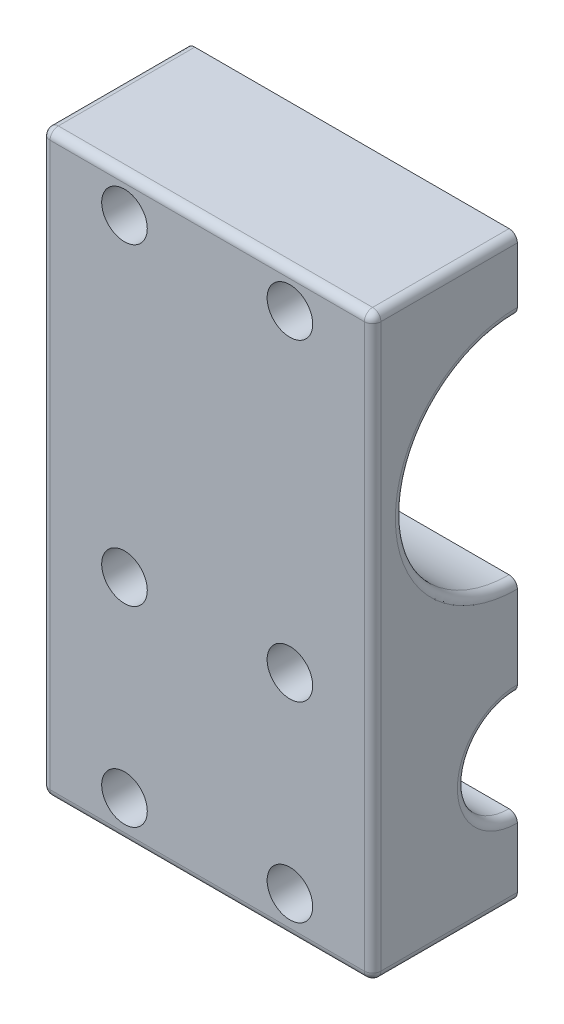
ISO-10303-21;
HEADER;
FILE_DESCRIPTION(('STEP AP214'),'2;1');
FILE_NAME('part.step','',(''),(''),'','','');
FILE_SCHEMA(('AUTOMOTIVE_DESIGN { 1 0 10303 214 1 1 1 1 }'));
ENDSEC;
DATA;
#1=APPLICATION_CONTEXT('core data for automotive mechanical design processes');
#2=APPLICATION_PROTOCOL_DEFINITION('international standard','automotive_design',2000,#1);
#3=PRODUCT_CONTEXT('',#1,'mechanical');
#4=PRODUCT('Part','Part','',(#3));
#5=PRODUCT_RELATED_PRODUCT_CATEGORY('part','',(#4));
#6=PRODUCT_DEFINITION_FORMATION('','',#4);
#7=PRODUCT_DEFINITION_CONTEXT('part definition',#1,'design');
#8=PRODUCT_DEFINITION('design','',#6,#7);
#9=PRODUCT_DEFINITION_SHAPE('','',#8);
#10=(LENGTH_UNIT() NAMED_UNIT(*) SI_UNIT(.MILLI.,.METRE.));
#11=(NAMED_UNIT(*) PLANE_ANGLE_UNIT() SI_UNIT($,.RADIAN.));
#12=(NAMED_UNIT(*) SI_UNIT($,.STERADIAN.) SOLID_ANGLE_UNIT());
#13=UNCERTAINTY_MEASURE_WITH_UNIT(LENGTH_MEASURE(1.E-05),#10,'distance_accuracy_value','');
#14=(GEOMETRIC_REPRESENTATION_CONTEXT(3) GLOBAL_UNCERTAINTY_ASSIGNED_CONTEXT((#13)) GLOBAL_UNIT_ASSIGNED_CONTEXT((#10,
#11,#12)) REPRESENTATION_CONTEXT('',''));
#15=CARTESIAN_POINT('',(0.,0.,0.));
#16=DIRECTION('',(0.,0.,1.));
#17=DIRECTION('',(1.,0.,0.));
#18=AXIS2_PLACEMENT_3D('',#15,#16,#17);
#19=CARTESIAN_POINT('',(0.,0.,-22.225));
#20=DIRECTION('',(0.,0.,1.));
#21=DIRECTION('',(1.,0.,0.));
#22=AXIS2_PLACEMENT_3D('',#19,#20,#21);
#23=PLANE('',#22);
#24=DIRECTION('',(1.,0.,0.));
#25=VECTOR('',#24,1.);
#26=CARTESIAN_POINT('',(50.8,88.9,-22.225));
#27=LINE('',#26,#25);
#28=CARTESIAN_POINT('',(1.27,88.9,-22.225));
#29=VERTEX_POINT('',#28);
#30=CARTESIAN_POINT('',(49.53,88.9,-22.225));
#31=VERTEX_POINT('',#30);
#32=EDGE_CURVE('E493',#29,#31,#27,.T.);
#33=ORIENTED_EDGE('',*,*,#32,.T.);
#34=CARTESIAN_POINT('',(49.53,87.63,-22.225));
#35=DIRECTION('',(0.,0.,1.));
#36=DIRECTION('',(1.,0.,0.));
#37=AXIS2_PLACEMENT_3D('',#34,#35,#36);
#38=CIRCLE('',#37,1.27);
#39=CARTESIAN_POINT('',(50.8,87.63,-22.225));
#40=VERTEX_POINT('',#39);
#41=EDGE_CURVE('E93',#31,#40,#38,.F.);
#42=ORIENTED_EDGE('',*,*,#41,.T.);
#43=DIRECTION('',(0.,-1.,0.));
#44=VECTOR('',#43,1.);
#45=CARTESIAN_POINT('',(50.8,0.,-22.225));
#46=LINE('',#45,#44);
#47=CARTESIAN_POINT('',(50.8,79.0575,-22.225));
#48=VERTEX_POINT('',#47);
#49=EDGE_CURVE('E86',#40,#48,#46,.T.);
#50=ORIENTED_EDGE('',*,*,#49,.T.);
#51=CARTESIAN_POINT('',(49.53,79.0575,-22.225));
#52=DIRECTION('',(0.,0.,1.));
#53=DIRECTION('',(1.,0.,0.));
#54=AXIS2_PLACEMENT_3D('',#51,#52,#53);
#55=CIRCLE('',#54,1.27);
#56=CARTESIAN_POINT('',(49.53,77.7875,-22.225));
#57=VERTEX_POINT('',#56);
#58=EDGE_CURVE('E216',#48,#57,#55,.F.);
#59=ORIENTED_EDGE('',*,*,#58,.T.);
#60=DIRECTION('',(-1.,0.,0.));
#61=VECTOR('',#60,1.);
#62=CARTESIAN_POINT('',(50.8,77.7875,-22.225));
#63=LINE('',#62,#61);
#64=CARTESIAN_POINT('',(1.27,77.7875,-22.225));
#65=VERTEX_POINT('',#64);
#66=EDGE_CURVE('E217',#57,#65,#63,.T.);
#67=ORIENTED_EDGE('',*,*,#66,.T.);
#68=CARTESIAN_POINT('',(1.27,79.0575,-22.225));
#69=DIRECTION('',(0.,0.,1.));
#70=DIRECTION('',(1.,0.,0.));
#71=AXIS2_PLACEMENT_3D('',#68,#69,#70);
#72=CIRCLE('',#71,1.27);
#73=CARTESIAN_POINT('',(0.,79.0575,-22.225));
#74=VERTEX_POINT('',#73);
#75=EDGE_CURVE('E79',#65,#74,#72,.F.);
#76=ORIENTED_EDGE('',*,*,#75,.T.);
#77=DIRECTION('',(0.,-1.,0.));
#78=VECTOR('',#77,1.);
#79=CARTESIAN_POINT('',(0.,0.,-22.225));
#80=LINE('',#79,#78);
#81=CARTESIAN_POINT('',(0.,87.63,-22.225));
#82=VERTEX_POINT('',#81);
#83=EDGE_CURVE('E209',#82,#74,#80,.T.);
#84=ORIENTED_EDGE('',*,*,#83,.F.);
#85=CARTESIAN_POINT('',(1.27,87.63,-22.225));
#86=DIRECTION('',(0.,0.,1.));
#87=DIRECTION('',(1.,0.,0.));
#88=AXIS2_PLACEMENT_3D('',#85,#86,#87);
#89=CIRCLE('',#88,1.27);
#90=EDGE_CURVE('E496',#82,#29,#89,.F.);
#91=ORIENTED_EDGE('',*,*,#90,.T.);
#92=EDGE_LOOP('',(#33,#42,#50,#59,#67,#76,#84,#91));
#93=FACE_BOUND('',#92,.T.);
#94=CARTESIAN_POINT('',(38.1,83.34375,-22.225));
#95=DIRECTION('',(0.,0.,1.));
#96=DIRECTION('',(1.,0.,0.));
#97=AXIS2_PLACEMENT_3D('',#94,#95,#96);
#98=CIRCLE('',#97,2.032);
#99=CARTESIAN_POINT('',(40.132,83.34375,-22.225));
#100=VERTEX_POINT('',#99);
#101=EDGE_CURVE('E432',#100,#100,#98,.F.);
#102=ORIENTED_EDGE('',*,*,#101,.F.);
#103=EDGE_LOOP('',(#102));
#104=FACE_BOUND('',#103,.T.);
#105=CARTESIAN_POINT('',(12.7,83.34375,-22.225));
#106=DIRECTION('',(0.,0.,1.));
#107=DIRECTION('',(1.,0.,0.));
#108=AXIS2_PLACEMENT_3D('',#105,#106,#107);
#109=CIRCLE('',#108,2.032);
#110=CARTESIAN_POINT('',(14.732,83.34375,-22.225));
#111=VERTEX_POINT('',#110);
#112=EDGE_CURVE('E277',#111,#111,#109,.F.);
#113=ORIENTED_EDGE('',*,*,#112,.F.);
#114=EDGE_LOOP('',(#113));
#115=FACE_BOUND('',#114,.T.);
#116=ADVANCED_FACE('F70',(#93,#104,#115),#23,.F.);
#117=CARTESIAN_POINT('',(12.7,83.34375,-44.45));
#118=DIRECTION('',(0.,0.,1.));
#119=DIRECTION('',(1.,0.,0.));
#120=AXIS2_PLACEMENT_3D('',#117,#118,#119);
#121=CYLINDRICAL_SURFACE('',#120,2.032);
#122=ORIENTED_EDGE('',*,*,#112,.T.);
#123=EDGE_LOOP('',(#122));
#124=FACE_BOUND('',#123,.T.);
#125=CARTESIAN_POINT('',(12.7,83.34375,-15.1765));
#126=DIRECTION('',(0.,0.,1.));
#127=DIRECTION('',(1.,0.,0.));
#128=AXIS2_PLACEMENT_3D('',#125,#126,#127);
#129=CIRCLE('',#128,2.032);
#130=CARTESIAN_POINT('',(14.732,83.34375,-15.1765));
#131=VERTEX_POINT('',#130);
#132=EDGE_CURVE('E350',#131,#131,#129,.F.);
#133=ORIENTED_EDGE('',*,*,#132,.F.);
#134=EDGE_LOOP('',(#133));
#135=FACE_BOUND('',#134,.T.);
#136=ADVANCED_FACE('F617',(#124,#135),#121,.F.);
#137=CARTESIAN_POINT('',(38.1,5.87374999999999,-44.45));
#138=DIRECTION('',(0.,0.,1.));
#139=DIRECTION('',(1.,0.,0.));
#140=AXIS2_PLACEMENT_3D('',#137,#138,#139);
#141=CYLINDRICAL_SURFACE('',#140,2.032);
#142=CARTESIAN_POINT('',(38.1,5.87374999999999,-22.225));
#143=DIRECTION('',(0.,0.,1.));
#144=DIRECTION('',(1.,0.,0.));
#145=AXIS2_PLACEMENT_3D('',#142,#143,#144);
#146=CIRCLE('',#145,2.032);
#147=CARTESIAN_POINT('',(40.132,5.87374999999999,-22.225));
#148=VERTEX_POINT('',#147);
#149=EDGE_CURVE('E424',#148,#148,#146,.F.);
#150=ORIENTED_EDGE('',*,*,#149,.T.);
#151=EDGE_LOOP('',(#150));
#152=FACE_BOUND('',#151,.T.);
#153=CARTESIAN_POINT('',(38.1,5.87374999999999,-15.1765));
#154=DIRECTION('',(0.,0.,1.));
#155=DIRECTION('',(1.,0.,0.));
#156=AXIS2_PLACEMENT_3D('',#153,#154,#155);
#157=CIRCLE('',#156,2.032);
#158=CARTESIAN_POINT('',(40.132,5.87374999999999,-15.1765));
#159=VERTEX_POINT('',#158);
#160=EDGE_CURVE('E354',#159,#159,#157,.F.);
#161=ORIENTED_EDGE('',*,*,#160,.F.);
#162=EDGE_LOOP('',(#161));
#163=FACE_BOUND('',#162,.T.);
#164=ADVANCED_FACE('F622',(#152,#163),#141,.F.);
#165=CARTESIAN_POINT('',(12.7,35.2425,-44.45));
#166=DIRECTION('',(0.,0.,1.));
#167=DIRECTION('',(1.,0.,0.));
#168=AXIS2_PLACEMENT_3D('',#165,#166,#167);
#169=CYLINDRICAL_SURFACE('',#168,2.032);
#170=CARTESIAN_POINT('',(12.7,35.2425,-22.225));
#171=DIRECTION('',(0.,0.,1.));
#172=DIRECTION('',(1.,0.,0.));
#173=AXIS2_PLACEMENT_3D('',#170,#171,#172);
#174=CIRCLE('',#173,2.032);
#175=CARTESIAN_POINT('',(14.732,35.2425,-22.225));
#176=VERTEX_POINT('',#175);
#177=EDGE_CURVE('E428',#176,#176,#174,.F.);
#178=ORIENTED_EDGE('',*,*,#177,.T.);
#179=EDGE_LOOP('',(#178));
#180=FACE_BOUND('',#179,.T.);
#181=CARTESIAN_POINT('',(12.7,35.2425,-15.1765));
#182=DIRECTION('',(0.,0.,1.));
#183=DIRECTION('',(1.,0.,0.));
#184=AXIS2_PLACEMENT_3D('',#181,#182,#183);
#185=CIRCLE('',#184,2.032);
#186=CARTESIAN_POINT('',(14.732,35.2425,-15.1765));
#187=VERTEX_POINT('',#186);
#188=EDGE_CURVE('E358',#187,#187,#185,.F.);
#189=ORIENTED_EDGE('',*,*,#188,.F.);
#190=EDGE_LOOP('',(#189));
#191=FACE_BOUND('',#190,.T.);
#192=ADVANCED_FACE('F683',(#180,#191),#169,.F.);
#193=CARTESIAN_POINT('',(38.1,83.34375,-44.45));
#194=DIRECTION('',(0.,0.,1.));
#195=DIRECTION('',(1.,0.,0.));
#196=AXIS2_PLACEMENT_3D('',#193,#194,#195);
#197=CYLINDRICAL_SURFACE('',#196,2.032);
#198=ORIENTED_EDGE('',*,*,#101,.T.);
#199=EDGE_LOOP('',(#198));
#200=FACE_BOUND('',#199,.T.);
#201=CARTESIAN_POINT('',(38.1,83.34375,-15.1765));
#202=DIRECTION('',(0.,0.,1.));
#203=DIRECTION('',(1.,0.,0.));
#204=AXIS2_PLACEMENT_3D('',#201,#202,#203);
#205=CIRCLE('',#204,2.032);
#206=CARTESIAN_POINT('',(40.132,83.34375,-15.1765));
#207=VERTEX_POINT('',#206);
#208=EDGE_CURVE('E362',#207,#207,#205,.F.);
#209=ORIENTED_EDGE('',*,*,#208,.F.);
#210=EDGE_LOOP('',(#209));
#211=FACE_BOUND('',#210,.T.);
#212=ADVANCED_FACE('F679',(#200,#211),#197,.F.);
#213=CARTESIAN_POINT('',(38.1,35.2425,-44.45));
#214=DIRECTION('',(0.,0.,1.));
#215=DIRECTION('',(1.,0.,0.));
#216=AXIS2_PLACEMENT_3D('',#213,#214,#215);
#217=CYLINDRICAL_SURFACE('',#216,2.032);
#218=CARTESIAN_POINT('',(38.1,35.2425,-22.225));
#219=DIRECTION('',(0.,0.,1.));
#220=DIRECTION('',(1.,0.,0.));
#221=AXIS2_PLACEMENT_3D('',#218,#219,#220);
#222=CIRCLE('',#221,2.032);
#223=CARTESIAN_POINT('',(40.132,35.2425,-22.225));
#224=VERTEX_POINT('',#223);
#225=EDGE_CURVE('E436',#224,#224,#222,.F.);
#226=ORIENTED_EDGE('',*,*,#225,.T.);
#227=EDGE_LOOP('',(#226));
#228=FACE_BOUND('',#227,.T.);
#229=CARTESIAN_POINT('',(38.1,35.2425,-15.1765));
#230=DIRECTION('',(0.,0.,1.));
#231=DIRECTION('',(1.,0.,0.));
#232=AXIS2_PLACEMENT_3D('',#229,#230,#231);
#233=CIRCLE('',#232,2.032);
#234=CARTESIAN_POINT('',(40.132,35.2425,-15.1765));
#235=VERTEX_POINT('',#234);
#236=EDGE_CURVE('E366',#235,#235,#233,.F.);
#237=ORIENTED_EDGE('',*,*,#236,.F.);
#238=EDGE_LOOP('',(#237));
#239=FACE_BOUND('',#238,.T.);
#240=ADVANCED_FACE('F682',(#228,#239),#217,.F.);
#241=CARTESIAN_POINT('',(12.7,5.87374999999999,-44.45));
#242=DIRECTION('',(0.,0.,1.));
#243=DIRECTION('',(1.,0.,0.));
#244=AXIS2_PLACEMENT_3D('',#241,#242,#243);
#245=CYLINDRICAL_SURFACE('',#244,2.032);
#246=CARTESIAN_POINT('',(12.7,5.87374999999999,-22.225));
#247=DIRECTION('',(0.,0.,1.));
#248=DIRECTION('',(1.,0.,0.));
#249=AXIS2_PLACEMENT_3D('',#246,#247,#248);
#250=CIRCLE('',#249,2.032);
#251=CARTESIAN_POINT('',(14.732,5.87374999999999,-22.225));
#252=VERTEX_POINT('',#251);
#253=EDGE_CURVE('E440',#252,#252,#250,.F.);
#254=ORIENTED_EDGE('',*,*,#253,.T.);
#255=EDGE_LOOP('',(#254));
#256=FACE_BOUND('',#255,.T.);
#257=CARTESIAN_POINT('',(12.7,5.87374999999999,-15.1765));
#258=DIRECTION('',(0.,0.,1.));
#259=DIRECTION('',(1.,0.,0.));
#260=AXIS2_PLACEMENT_3D('',#257,#258,#259);
#261=CIRCLE('',#260,2.032);
#262=CARTESIAN_POINT('',(14.732,5.87374999999999,-15.1765));
#263=VERTEX_POINT('',#262);
#264=EDGE_CURVE('E370',#263,#263,#261,.F.);
#265=ORIENTED_EDGE('',*,*,#264,.F.);
#266=EDGE_LOOP('',(#265));
#267=FACE_BOUND('',#266,.T.);
#268=ADVANCED_FACE('F673',(#256,#267),#245,.F.);
#269=CARTESIAN_POINT('',(50.8,0.,0.));
#270=DIRECTION('',(1.,0.,0.));
#271=DIRECTION('',(0.,0.,-1.));
#272=AXIS2_PLACEMENT_3D('',#269,#270,#271);
#273=PLANE('',#272);
#274=ORIENTED_EDGE('',*,*,#49,.F.);
#275=DIRECTION('',(0.,0.,-1.));
#276=VECTOR('',#275,1.);
#277=CARTESIAN_POINT('',(50.8,87.63,0.));
#278=LINE('',#277,#276);
#279=CARTESIAN_POINT('',(50.8,87.63,-1.26999999999999));
#280=VERTEX_POINT('',#279);
#281=EDGE_CURVE('E305',#40,#280,#278,.F.);
#282=ORIENTED_EDGE('',*,*,#281,.T.);
#283=DIRECTION('',(0.,1.,0.));
#284=VECTOR('',#283,1.);
#285=CARTESIAN_POINT('',(50.8,0.,-1.27));
#286=LINE('',#285,#284);
#287=CARTESIAN_POINT('',(50.8,1.27,-1.27));
#288=VERTEX_POINT('',#287);
#289=EDGE_CURVE('E302',#280,#288,#286,.F.);
#290=ORIENTED_EDGE('',*,*,#289,.T.);
#291=DIRECTION('',(0.,0.,-1.));
#292=VECTOR('',#291,1.);
#293=CARTESIAN_POINT('',(50.8,1.27,-44.45));
#294=LINE('',#293,#292);
#295=CARTESIAN_POINT('',(50.8,1.27,-22.225));
#296=VERTEX_POINT('',#295);
#297=EDGE_CURVE('E298',#288,#296,#294,.T.);
#298=ORIENTED_EDGE('',*,*,#297,.T.);
#299=CARTESIAN_POINT('',(50.8,10.4775,-22.225));
#300=VERTEX_POINT('',#299);
#301=EDGE_CURVE('E459',#300,#296,#46,.T.);
#302=ORIENTED_EDGE('',*,*,#301,.F.);
#303=CARTESIAN_POINT('',(50.8,19.685,-22.225));
#304=DIRECTION('',(1.,0.,0.));
#305=DIRECTION('',(0.,0.,-1.));
#306=AXIS2_PLACEMENT_3D('',#303,#304,#305);
#307=CIRCLE('',#306,9.2075);
#308=CARTESIAN_POINT('',(50.8,28.8925,-22.225));
#309=VERTEX_POINT('',#308);
#310=EDGE_CURVE('E291',#300,#309,#307,.F.);
#311=ORIENTED_EDGE('',*,*,#310,.T.);
#312=CARTESIAN_POINT('',(50.8,41.5925,-22.225));
#313=VERTEX_POINT('',#312);
#314=EDGE_CURVE('E472',#313,#309,#46,.T.);
#315=ORIENTED_EDGE('',*,*,#314,.F.);
#316=CARTESIAN_POINT('',(50.8,60.325,-22.225));
#317=DIRECTION('',(1.,0.,0.));
#318=DIRECTION('',(0.,0.,-1.));
#319=AXIS2_PLACEMENT_3D('',#316,#317,#318);
#320=CIRCLE('',#319,18.7325);
#321=EDGE_CURVE('E295',#313,#48,#320,.F.);
#322=ORIENTED_EDGE('',*,*,#321,.T.);
#323=EDGE_LOOP('',(#274,#282,#290,#298,#302,#311,#315,#322));
#324=FACE_BOUND('',#323,.T.);
#325=ADVANCED_FACE('F562',(#324),#273,.T.);
#326=CARTESIAN_POINT('',(0.,0.,0.));
#327=DIRECTION('',(1.,0.,0.));
#328=DIRECTION('',(0.,0.,-1.));
#329=AXIS2_PLACEMENT_3D('',#326,#327,#328);
#330=PLANE('',#329);
#331=DIRECTION('',(0.,0.,-1.));
#332=VECTOR('',#331,1.);
#333=CARTESIAN_POINT('',(0.,87.63,-44.45));
#334=LINE('',#333,#332);
#335=CARTESIAN_POINT('',(0.,87.63,-1.26999999999999));
#336=VERTEX_POINT('',#335);
#337=EDGE_CURVE('E212',#336,#82,#334,.T.);
#338=ORIENTED_EDGE('',*,*,#337,.T.);
#339=ORIENTED_EDGE('',*,*,#83,.T.);
#340=CARTESIAN_POINT('',(0.,60.325,-22.225));
#341=DIRECTION('',(1.,0.,0.));
#342=DIRECTION('',(0.,0.,-1.));
#343=AXIS2_PLACEMENT_3D('',#340,#341,#342);
#344=CIRCLE('',#343,18.7325);
#345=CARTESIAN_POINT('',(0.,41.5925,-22.225));
#346=VERTEX_POINT('',#345);
#347=EDGE_CURVE('E197',#74,#346,#344,.T.);
#348=ORIENTED_EDGE('',*,*,#347,.T.);
#349=CARTESIAN_POINT('',(0.,28.8925,-22.225));
#350=VERTEX_POINT('',#349);
#351=EDGE_CURVE('E220',#346,#350,#80,.T.);
#352=ORIENTED_EDGE('',*,*,#351,.T.);
#353=CARTESIAN_POINT('',(0.,19.685,-22.225));
#354=DIRECTION('',(1.,0.,0.));
#355=DIRECTION('',(0.,0.,-1.));
#356=AXIS2_PLACEMENT_3D('',#353,#354,#355);
#357=CIRCLE('',#356,9.2075);
#358=CARTESIAN_POINT('',(0.,10.4775,-22.225));
#359=VERTEX_POINT('',#358);
#360=EDGE_CURVE('E204',#350,#359,#357,.T.);
#361=ORIENTED_EDGE('',*,*,#360,.T.);
#362=CARTESIAN_POINT('',(0.,1.27,-22.225));
#363=VERTEX_POINT('',#362);
#364=EDGE_CURVE('E219',#359,#363,#80,.T.);
#365=ORIENTED_EDGE('',*,*,#364,.T.);
#366=DIRECTION('',(0.,0.,-1.));
#367=VECTOR('',#366,1.);
#368=CARTESIAN_POINT('',(0.,1.27,0.));
#369=LINE('',#368,#367);
#370=CARTESIAN_POINT('',(0.,1.27,-1.27));
#371=VERTEX_POINT('',#370);
#372=EDGE_CURVE('E205',#363,#371,#369,.F.);
#373=ORIENTED_EDGE('',*,*,#372,.T.);
#374=DIRECTION('',(0.,1.,0.));
#375=VECTOR('',#374,1.);
#376=CARTESIAN_POINT('',(0.,88.9,-1.26999999999999));
#377=LINE('',#376,#375);
#378=EDGE_CURVE('E321',#371,#336,#377,.T.);
#379=ORIENTED_EDGE('',*,*,#378,.T.);
#380=EDGE_LOOP('',(#338,#339,#348,#352,#361,#365,#373,#379));
#381=FACE_BOUND('',#380,.T.);
#382=ADVANCED_FACE('F210',(#381),#330,.F.);
#383=CARTESIAN_POINT('',(50.8,0.,0.));
#384=DIRECTION('',(0.,1.,0.));
#385=DIRECTION('',(0.,0.,1.));
#386=AXIS2_PLACEMENT_3D('',#383,#384,#385);
#387=PLANE('',#386);
#388=DIRECTION('',(0.,0.,-1.));
#389=VECTOR('',#388,1.);
#390=CARTESIAN_POINT('',(1.27,0.,0.));
#391=LINE('',#390,#389);
#392=CARTESIAN_POINT('',(1.27,0.,-1.27));
#393=VERTEX_POINT('',#392);
#394=CARTESIAN_POINT('',(1.27,0.,-22.225));
#395=VERTEX_POINT('',#394);
#396=EDGE_CURVE('E339',#393,#395,#391,.T.);
#397=ORIENTED_EDGE('',*,*,#396,.T.);
#398=DIRECTION('',(1.,0.,0.));
#399=VECTOR('',#398,1.);
#400=CARTESIAN_POINT('',(50.8,0.,-22.225));
#401=LINE('',#400,#399);
#402=CARTESIAN_POINT('',(49.53,0.,-22.225));
#403=VERTEX_POINT('',#402);
#404=EDGE_CURVE('E448',#395,#403,#401,.T.);
#405=ORIENTED_EDGE('',*,*,#404,.T.);
#406=DIRECTION('',(0.,0.,-1.));
#407=VECTOR('',#406,1.);
#408=CARTESIAN_POINT('',(49.53,0.,0.));
#409=LINE('',#408,#407);
#410=CARTESIAN_POINT('',(49.53,0.,-1.27));
#411=VERTEX_POINT('',#410);
#412=EDGE_CURVE('E347',#403,#411,#409,.F.);
#413=ORIENTED_EDGE('',*,*,#412,.T.);
#414=DIRECTION('',(-1.,0.,0.));
#415=VECTOR('',#414,1.);
#416=CARTESIAN_POINT('',(0.,0.,-1.27));
#417=LINE('',#416,#415);
#418=EDGE_CURVE('E343',#411,#393,#417,.T.);
#419=ORIENTED_EDGE('',*,*,#418,.T.);
#420=EDGE_LOOP('',(#397,#405,#413,#419));
#421=FACE_BOUND('',#420,.T.);
#422=ADVANCED_FACE('F522',(#421),#387,.F.);
#423=CARTESIAN_POINT('',(50.8,88.9,0.));
#424=DIRECTION('',(0.,1.,0.));
#425=DIRECTION('',(0.,0.,1.));
#426=AXIS2_PLACEMENT_3D('',#423,#424,#425);
#427=PLANE('',#426);
#428=ORIENTED_EDGE('',*,*,#32,.F.);
#429=DIRECTION('',(0.,0.,-1.));
#430=VECTOR('',#429,1.);
#431=CARTESIAN_POINT('',(1.27,88.9,0.));
#432=LINE('',#431,#430);
#433=CARTESIAN_POINT('',(1.27,88.9,-1.26999999999999));
#434=VERTEX_POINT('',#433);
#435=EDGE_CURVE('E229',#29,#434,#432,.F.);
#436=ORIENTED_EDGE('',*,*,#435,.T.);
#437=DIRECTION('',(-1.,0.,0.));
#438=VECTOR('',#437,1.);
#439=CARTESIAN_POINT('',(50.8,88.9,-1.26999999999999));
#440=LINE('',#439,#438);
#441=CARTESIAN_POINT('',(49.53,88.9,-1.26999999999999));
#442=VERTEX_POINT('',#441);
#443=EDGE_CURVE('E226',#434,#442,#440,.F.);
#444=ORIENTED_EDGE('',*,*,#443,.T.);
#445=DIRECTION('',(0.,0.,-1.));
#446=VECTOR('',#445,1.);
#447=CARTESIAN_POINT('',(49.53,88.9,0.));
#448=LINE('',#447,#446);
#449=EDGE_CURVE('E281',#442,#31,#448,.T.);
#450=ORIENTED_EDGE('',*,*,#449,.T.);
#451=EDGE_LOOP('',(#428,#436,#444,#450));
#452=FACE_BOUND('',#451,.T.);
#453=ADVANCED_FACE('F557',(#452),#427,.T.);
#454=CARTESIAN_POINT('',(50.8,0.,0.));
#455=DIRECTION('',(0.,0.,1.));
#456=DIRECTION('',(0.,-1.,0.));
#457=AXIS2_PLACEMENT_3D('',#454,#455,#456);
#458=PLANE('',#457);
#459=DIRECTION('',(0.,1.,0.));
#460=VECTOR('',#459,1.);
#461=CARTESIAN_POINT('',(1.27,0.,0.));
#462=LINE('',#461,#460);
#463=CARTESIAN_POINT('',(1.27,87.63,0.));
#464=VERTEX_POINT('',#463);
#465=CARTESIAN_POINT('',(1.27,1.27,0.));
#466=VERTEX_POINT('',#465);
#467=EDGE_CURVE('E333',#464,#466,#462,.F.);
#468=ORIENTED_EDGE('',*,*,#467,.T.);
#469=DIRECTION('',(-1.,0.,0.));
#470=VECTOR('',#469,1.);
#471=CARTESIAN_POINT('',(50.8,1.27,0.));
#472=LINE('',#471,#470);
#473=CARTESIAN_POINT('',(49.53,1.27,0.));
#474=VERTEX_POINT('',#473);
#475=EDGE_CURVE('E326',#466,#474,#472,.F.);
#476=ORIENTED_EDGE('',*,*,#475,.T.);
#477=DIRECTION('',(0.,1.,0.));
#478=VECTOR('',#477,1.);
#479=CARTESIAN_POINT('',(49.53,0.,0.));
#480=LINE('',#479,#478);
#481=CARTESIAN_POINT('',(49.53,87.63,0.));
#482=VERTEX_POINT('',#481);
#483=EDGE_CURVE('E330',#474,#482,#480,.T.);
#484=ORIENTED_EDGE('',*,*,#483,.T.);
#485=DIRECTION('',(-1.,0.,0.));
#486=VECTOR('',#485,1.);
#487=CARTESIAN_POINT('',(50.8,87.63,0.));
#488=LINE('',#487,#486);
#489=EDGE_CURVE('E336',#482,#464,#488,.T.);
#490=ORIENTED_EDGE('',*,*,#489,.T.);
#491=EDGE_LOOP('',(#468,#476,#484,#490));
#492=FACE_BOUND('',#491,.T.);
#493=CARTESIAN_POINT('',(38.1,83.34375,0.));
#494=DIRECTION('',(0.,0.,1.));
#495=DIRECTION('',(1.,0.,0.));
#496=AXIS2_PLACEMENT_3D('',#493,#494,#495);
#497=CIRCLE('',#496,3.5);
#498=CARTESIAN_POINT('',(41.6,83.34375,0.));
#499=VERTEX_POINT('',#498);
#500=EDGE_CURVE('E379',#499,#499,#497,.T.);
#501=ORIENTED_EDGE('',*,*,#500,.F.);
#502=EDGE_LOOP('',(#501));
#503=FACE_BOUND('',#502,.T.);
#504=CARTESIAN_POINT('',(38.1,35.2425,0.));
#505=DIRECTION('',(0.,0.,1.));
#506=DIRECTION('',(1.,0.,0.));
#507=AXIS2_PLACEMENT_3D('',#504,#505,#506);
#508=CIRCLE('',#507,3.5);
#509=CARTESIAN_POINT('',(41.6,35.2425,0.));
#510=VERTEX_POINT('',#509);
#511=EDGE_CURVE('E404',#510,#510,#508,.T.);
#512=ORIENTED_EDGE('',*,*,#511,.F.);
#513=EDGE_LOOP('',(#512));
#514=FACE_BOUND('',#513,.T.);
#515=CARTESIAN_POINT('',(12.7,35.2425,0.));
#516=DIRECTION('',(0.,0.,1.));
#517=DIRECTION('',(1.,0.,0.));
#518=AXIS2_PLACEMENT_3D('',#515,#516,#517);
#519=CIRCLE('',#518,3.5);
#520=CARTESIAN_POINT('',(16.2,35.2425,0.));
#521=VERTEX_POINT('',#520);
#522=EDGE_CURVE('E396',#521,#521,#519,.T.);
#523=ORIENTED_EDGE('',*,*,#522,.F.);
#524=EDGE_LOOP('',(#523));
#525=FACE_BOUND('',#524,.T.);
#526=CARTESIAN_POINT('',(12.7,5.87374999999999,0.));
#527=DIRECTION('',(0.,0.,1.));
#528=DIRECTION('',(1.,0.,0.));
#529=AXIS2_PLACEMENT_3D('',#526,#527,#528);
#530=CIRCLE('',#529,3.5);
#531=CARTESIAN_POINT('',(16.2,5.87374999999999,0.));
#532=VERTEX_POINT('',#531);
#533=EDGE_CURVE('E387',#532,#532,#530,.T.);
#534=ORIENTED_EDGE('',*,*,#533,.F.);
#535=EDGE_LOOP('',(#534));
#536=FACE_BOUND('',#535,.T.);
#537=CARTESIAN_POINT('',(38.1,5.87374999999999,0.));
#538=DIRECTION('',(0.,0.,1.));
#539=DIRECTION('',(1.,0.,0.));
#540=AXIS2_PLACEMENT_3D('',#537,#538,#539);
#541=CIRCLE('',#540,3.5);
#542=CARTESIAN_POINT('',(41.6,5.87374999999999,0.));
#543=VERTEX_POINT('',#542);
#544=EDGE_CURVE('E388',#543,#543,#541,.T.);
#545=ORIENTED_EDGE('',*,*,#544,.F.);
#546=EDGE_LOOP('',(#545));
#547=FACE_BOUND('',#546,.T.);
#548=CARTESIAN_POINT('',(12.7,83.34375,0.));
#549=DIRECTION('',(0.,0.,1.));
#550=DIRECTION('',(1.,0.,0.));
#551=AXIS2_PLACEMENT_3D('',#548,#549,#550);
#552=CIRCLE('',#551,3.5);
#553=CARTESIAN_POINT('',(16.2,83.34375,0.));
#554=VERTEX_POINT('',#553);
#555=EDGE_CURVE('E375',#554,#554,#552,.T.);
#556=ORIENTED_EDGE('',*,*,#555,.F.);
#557=EDGE_LOOP('',(#556));
#558=FACE_BOUND('',#557,.T.);
#559=ADVANCED_FACE('F584',(#492,#503,#514,#525,#536,#547,#558),#458,.T.);
#560=CARTESIAN_POINT('',(50.8,60.325,-22.225));
#561=DIRECTION('',(-1.,0.,0.));
#562=DIRECTION('',(0.,0.,1.));
#563=AXIS2_PLACEMENT_3D('',#560,#561,#562);
#564=CYLINDRICAL_SURFACE('',#563,17.4625);
#565=ORIENTED_EDGE('',*,*,#66,.F.);
#566=CARTESIAN_POINT('',(49.53,60.325,-22.225));
#567=DIRECTION('',(1.,0.,0.));
#568=DIRECTION('',(0.,0.,-1.));
#569=AXIS2_PLACEMENT_3D('',#566,#567,#568);
#570=CIRCLE('',#569,17.4625);
#571=CARTESIAN_POINT('',(49.53,42.8625,-22.225));
#572=VERTEX_POINT('',#571);
#573=EDGE_CURVE('E284',#57,#572,#570,.T.);
#574=ORIENTED_EDGE('',*,*,#573,.T.);
#575=DIRECTION('',(-1.,0.,0.));
#576=VECTOR('',#575,1.);
#577=CARTESIAN_POINT('',(50.8,42.8625,-22.225));
#578=LINE('',#577,#576);
#579=CARTESIAN_POINT('',(1.27,42.8625,-22.225));
#580=VERTEX_POINT('',#579);
#581=EDGE_CURVE('E485',#580,#572,#578,.F.);
#582=ORIENTED_EDGE('',*,*,#581,.F.);
#583=CARTESIAN_POINT('',(1.27,60.325,-22.225));
#584=DIRECTION('',(1.,0.,0.));
#585=DIRECTION('',(0.,0.,-1.));
#586=AXIS2_PLACEMENT_3D('',#583,#584,#585);
#587=CIRCLE('',#586,17.4625);
#588=EDGE_CURVE('E288',#580,#65,#587,.F.);
#589=ORIENTED_EDGE('',*,*,#588,.T.);
#590=EDGE_LOOP('',(#565,#574,#582,#589));
#591=FACE_BOUND('',#590,.T.);
#592=ADVANCED_FACE('F569',(#591),#564,.F.);
#593=CARTESIAN_POINT('',(50.8,19.685,-22.225));
#594=DIRECTION('',(-1.,0.,0.));
#595=DIRECTION('',(0.,0.,1.));
#596=AXIS2_PLACEMENT_3D('',#593,#594,#595);
#597=CYLINDRICAL_SURFACE('',#596,7.93750000000001);
#598=DIRECTION('',(-1.,0.,0.));
#599=VECTOR('',#598,1.);
#600=CARTESIAN_POINT('',(50.8,27.6225,-22.225));
#601=LINE('',#600,#599);
#602=CARTESIAN_POINT('',(49.53,27.6225,-22.225));
#603=VERTEX_POINT('',#602);
#604=CARTESIAN_POINT('',(1.27,27.6225,-22.225));
#605=VERTEX_POINT('',#604);
#606=EDGE_CURVE('E473',#603,#605,#601,.T.);
#607=ORIENTED_EDGE('',*,*,#606,.F.);
#608=CARTESIAN_POINT('',(49.53,19.685,-22.225));
#609=DIRECTION('',(1.,0.,0.));
#610=DIRECTION('',(0.,0.,-1.));
#611=AXIS2_PLACEMENT_3D('',#608,#609,#610);
#612=CIRCLE('',#611,7.93750000000001);
#613=CARTESIAN_POINT('',(49.53,11.7475,-22.225));
#614=VERTEX_POINT('',#613);
#615=EDGE_CURVE('E312',#603,#614,#612,.T.);
#616=ORIENTED_EDGE('',*,*,#615,.T.);
#617=DIRECTION('',(-1.,0.,0.));
#618=VECTOR('',#617,1.);
#619=CARTESIAN_POINT('',(50.8,11.7475,-22.225));
#620=LINE('',#619,#618);
#621=CARTESIAN_POINT('',(1.27,11.7475,-22.225));
#622=VERTEX_POINT('',#621);
#623=EDGE_CURVE('E460',#622,#614,#620,.F.);
#624=ORIENTED_EDGE('',*,*,#623,.F.);
#625=CARTESIAN_POINT('',(1.27,19.685,-22.225));
#626=DIRECTION('',(1.,0.,0.));
#627=DIRECTION('',(0.,0.,-1.));
#628=AXIS2_PLACEMENT_3D('',#625,#626,#627);
#629=CIRCLE('',#628,7.93750000000001);
#630=EDGE_CURVE('E308',#622,#605,#629,.F.);
#631=ORIENTED_EDGE('',*,*,#630,.T.);
#632=EDGE_LOOP('',(#607,#616,#624,#631));
#633=FACE_BOUND('',#632,.T.);
#634=ADVANCED_FACE('F574',(#633),#597,.F.);
#635=CARTESIAN_POINT('',(12.7,5.87374999999999,-15.1765));
#636=DIRECTION('',(0.,0.,1.));
#637=DIRECTION('',(1.,0.,0.));
#638=AXIS2_PLACEMENT_3D('',#635,#636,#637);
#639=PLANE('',#638);
#640=CARTESIAN_POINT('',(12.7,5.87374999999999,-15.1765));
#641=DIRECTION('',(0.,0.,1.));
#642=DIRECTION('',(1.,0.,0.));
#643=AXIS2_PLACEMENT_3D('',#640,#641,#642);
#644=CIRCLE('',#643,3.5);
#645=CARTESIAN_POINT('',(16.2,5.87374999999999,-15.1765));
#646=VERTEX_POINT('',#645);
#647=EDGE_CURVE('E383',#646,#646,#644,.T.);
#648=ORIENTED_EDGE('',*,*,#647,.T.);
#649=EDGE_LOOP('',(#648));
#650=FACE_BOUND('',#649,.T.);
#651=ORIENTED_EDGE('',*,*,#264,.T.);
#652=EDGE_LOOP('',(#651));
#653=FACE_BOUND('',#652,.T.);
#654=ADVANCED_FACE('F677',(#650,#653),#639,.T.);
#655=CARTESIAN_POINT('',(12.7,5.87374999999999,-15.1765));
#656=DIRECTION('',(0.,0.,1.));
#657=DIRECTION('',(1.,0.,0.));
#658=AXIS2_PLACEMENT_3D('',#655,#656,#657);
#659=CYLINDRICAL_SURFACE('',#658,3.5);
#660=ORIENTED_EDGE('',*,*,#647,.F.);
#661=EDGE_LOOP('',(#660));
#662=FACE_BOUND('',#661,.T.);
#663=ORIENTED_EDGE('',*,*,#533,.T.);
#664=EDGE_LOOP('',(#663));
#665=FACE_BOUND('',#664,.T.);
#666=ADVANCED_FACE('F729',(#662,#665),#659,.F.);
#667=CARTESIAN_POINT('',(38.1,35.2425,-15.1765));
#668=DIRECTION('',(0.,0.,1.));
#669=DIRECTION('',(1.,0.,0.));
#670=AXIS2_PLACEMENT_3D('',#667,#668,#669);
#671=PLANE('',#670);
#672=CARTESIAN_POINT('',(38.1,35.2425,-15.1765));
#673=DIRECTION('',(0.,0.,1.));
#674=DIRECTION('',(1.,0.,0.));
#675=AXIS2_PLACEMENT_3D('',#672,#673,#674);
#676=CIRCLE('',#675,3.5);
#677=CARTESIAN_POINT('',(41.6,35.2425,-15.1765));
#678=VERTEX_POINT('',#677);
#679=EDGE_CURVE('E400',#678,#678,#676,.T.);
#680=ORIENTED_EDGE('',*,*,#679,.T.);
#681=EDGE_LOOP('',(#680));
#682=FACE_BOUND('',#681,.T.);
#683=ORIENTED_EDGE('',*,*,#236,.T.);
#684=EDGE_LOOP('',(#683));
#685=FACE_BOUND('',#684,.T.);
#686=ADVANCED_FACE('F726',(#682,#685),#671,.T.);
#687=CARTESIAN_POINT('',(38.1,35.2425,-15.1765));
#688=DIRECTION('',(0.,0.,1.));
#689=DIRECTION('',(1.,0.,0.));
#690=AXIS2_PLACEMENT_3D('',#687,#688,#689);
#691=CYLINDRICAL_SURFACE('',#690,3.5);
#692=ORIENTED_EDGE('',*,*,#679,.F.);
#693=EDGE_LOOP('',(#692));
#694=FACE_BOUND('',#693,.T.);
#695=ORIENTED_EDGE('',*,*,#511,.T.);
#696=EDGE_LOOP('',(#695));
#697=FACE_BOUND('',#696,.T.);
#698=ADVANCED_FACE('F722',(#694,#697),#691,.F.);
#699=CARTESIAN_POINT('',(38.1,83.34375,-15.1765));
#700=DIRECTION('',(0.,0.,1.));
#701=DIRECTION('',(1.,0.,0.));
#702=AXIS2_PLACEMENT_3D('',#699,#700,#701);
#703=PLANE('',#702);
#704=CARTESIAN_POINT('',(38.1,83.34375,-15.1765));
#705=DIRECTION('',(0.,0.,1.));
#706=DIRECTION('',(1.,0.,0.));
#707=AXIS2_PLACEMENT_3D('',#704,#705,#706);
#708=CIRCLE('',#707,3.5);
#709=CARTESIAN_POINT('',(41.6,83.34375,-15.1765));
#710=VERTEX_POINT('',#709);
#711=EDGE_CURVE('E408',#710,#710,#708,.T.);
#712=ORIENTED_EDGE('',*,*,#711,.T.);
#713=EDGE_LOOP('',(#712));
#714=FACE_BOUND('',#713,.T.);
#715=ORIENTED_EDGE('',*,*,#208,.T.);
#716=EDGE_LOOP('',(#715));
#717=FACE_BOUND('',#716,.T.);
#718=ADVANCED_FACE('F718',(#714,#717),#703,.T.);
#719=CARTESIAN_POINT('',(38.1,83.34375,-15.1765));
#720=DIRECTION('',(0.,0.,1.));
#721=DIRECTION('',(1.,0.,0.));
#722=AXIS2_PLACEMENT_3D('',#719,#720,#721);
#723=CYLINDRICAL_SURFACE('',#722,3.5);
#724=ORIENTED_EDGE('',*,*,#711,.F.);
#725=EDGE_LOOP('',(#724));
#726=FACE_BOUND('',#725,.T.);
#727=ORIENTED_EDGE('',*,*,#500,.T.);
#728=EDGE_LOOP('',(#727));
#729=FACE_BOUND('',#728,.T.);
#730=ADVANCED_FACE('F715',(#726,#729),#723,.F.);
#731=CARTESIAN_POINT('',(12.7,35.2425,-15.1765));
#732=DIRECTION('',(0.,0.,1.));
#733=DIRECTION('',(1.,0.,0.));
#734=AXIS2_PLACEMENT_3D('',#731,#732,#733);
#735=PLANE('',#734);
#736=CARTESIAN_POINT('',(12.7,35.2425,-15.1765));
#737=DIRECTION('',(0.,0.,1.));
#738=DIRECTION('',(1.,0.,0.));
#739=AXIS2_PLACEMENT_3D('',#736,#737,#738);
#740=CIRCLE('',#739,3.5);
#741=CARTESIAN_POINT('',(16.2,35.2425,-15.1765));
#742=VERTEX_POINT('',#741);
#743=EDGE_CURVE('E392',#742,#742,#740,.T.);
#744=ORIENTED_EDGE('',*,*,#743,.T.);
#745=EDGE_LOOP('',(#744));
#746=FACE_BOUND('',#745,.T.);
#747=ORIENTED_EDGE('',*,*,#188,.T.);
#748=EDGE_LOOP('',(#747));
#749=FACE_BOUND('',#748,.T.);
#750=ADVANCED_FACE('F711',(#746,#749),#735,.T.);
#751=CARTESIAN_POINT('',(12.7,35.2425,-15.1765));
#752=DIRECTION('',(0.,0.,1.));
#753=DIRECTION('',(1.,0.,0.));
#754=AXIS2_PLACEMENT_3D('',#751,#752,#753);
#755=CYLINDRICAL_SURFACE('',#754,3.5);
#756=ORIENTED_EDGE('',*,*,#743,.F.);
#757=EDGE_LOOP('',(#756));
#758=FACE_BOUND('',#757,.T.);
#759=ORIENTED_EDGE('',*,*,#522,.T.);
#760=EDGE_LOOP('',(#759));
#761=FACE_BOUND('',#760,.T.);
#762=ADVANCED_FACE('F703',(#758,#761),#755,.F.);
#763=CARTESIAN_POINT('',(38.1,5.87374999999999,-15.1765));
#764=DIRECTION('',(0.,0.,1.));
#765=DIRECTION('',(1.,0.,0.));
#766=AXIS2_PLACEMENT_3D('',#763,#764,#765);
#767=PLANE('',#766);
#768=CARTESIAN_POINT('',(38.1,5.87374999999999,-15.1765));
#769=DIRECTION('',(0.,0.,1.));
#770=DIRECTION('',(1.,0.,0.));
#771=AXIS2_PLACEMENT_3D('',#768,#769,#770);
#772=CIRCLE('',#771,3.5);
#773=CARTESIAN_POINT('',(41.6,5.87374999999999,-15.1765));
#774=VERTEX_POINT('',#773);
#775=EDGE_CURVE('E236',#774,#774,#772,.T.);
#776=ORIENTED_EDGE('',*,*,#775,.T.);
#777=EDGE_LOOP('',(#776));
#778=FACE_BOUND('',#777,.T.);
#779=ORIENTED_EDGE('',*,*,#160,.T.);
#780=EDGE_LOOP('',(#779));
#781=FACE_BOUND('',#780,.T.);
#782=ADVANCED_FACE('F701',(#778,#781),#767,.T.);
#783=CARTESIAN_POINT('',(38.1,5.87374999999999,-15.1765));
#784=DIRECTION('',(0.,0.,1.));
#785=DIRECTION('',(1.,0.,0.));
#786=AXIS2_PLACEMENT_3D('',#783,#784,#785);
#787=CYLINDRICAL_SURFACE('',#786,3.5);
#788=ORIENTED_EDGE('',*,*,#775,.F.);
#789=EDGE_LOOP('',(#788));
#790=FACE_BOUND('',#789,.T.);
#791=ORIENTED_EDGE('',*,*,#544,.T.);
#792=EDGE_LOOP('',(#791));
#793=FACE_BOUND('',#792,.T.);
#794=ADVANCED_FACE('F611',(#790,#793),#787,.F.);
#795=CARTESIAN_POINT('',(12.7,83.34375,-15.1765));
#796=DIRECTION('',(0.,0.,1.));
#797=DIRECTION('',(1.,0.,0.));
#798=AXIS2_PLACEMENT_3D('',#795,#796,#797);
#799=PLANE('',#798);
#800=CARTESIAN_POINT('',(12.7,83.34375,-15.1765));
#801=DIRECTION('',(0.,0.,1.));
#802=DIRECTION('',(1.,0.,0.));
#803=AXIS2_PLACEMENT_3D('',#800,#801,#802);
#804=CIRCLE('',#803,3.5);
#805=CARTESIAN_POINT('',(16.2,83.34375,-15.1765));
#806=VERTEX_POINT('',#805);
#807=EDGE_CURVE('E374',#806,#806,#804,.T.);
#808=ORIENTED_EDGE('',*,*,#807,.T.);
#809=EDGE_LOOP('',(#808));
#810=FACE_BOUND('',#809,.T.);
#811=ORIENTED_EDGE('',*,*,#132,.T.);
#812=EDGE_LOOP('',(#811));
#813=FACE_BOUND('',#812,.T.);
#814=ADVANCED_FACE('F603',(#810,#813),#799,.T.);
#815=CARTESIAN_POINT('',(12.7,83.34375,-15.1765));
#816=DIRECTION('',(0.,0.,1.));
#817=DIRECTION('',(1.,0.,0.));
#818=AXIS2_PLACEMENT_3D('',#815,#816,#817);
#819=CYLINDRICAL_SURFACE('',#818,3.5);
#820=ORIENTED_EDGE('',*,*,#807,.F.);
#821=EDGE_LOOP('',(#820));
#822=FACE_BOUND('',#821,.T.);
#823=ORIENTED_EDGE('',*,*,#555,.T.);
#824=EDGE_LOOP('',(#823));
#825=FACE_BOUND('',#824,.T.);
#826=ADVANCED_FACE('F600',(#822,#825),#819,.F.);
#827=CARTESIAN_POINT('',(49.53,87.63,0.));
#828=DIRECTION('',(0.,0.,-1.));
#829=DIRECTION('',(-1.,0.,0.));
#830=AXIS2_PLACEMENT_3D('',#827,#828,#829);
#831=CYLINDRICAL_SURFACE('',#830,1.27);
#832=ORIENTED_EDGE('',*,*,#41,.F.);
#833=ORIENTED_EDGE('',*,*,#449,.F.);
#834=CARTESIAN_POINT('',(49.53,87.63,-1.26999999999999));
#835=DIRECTION('',(0.,0.,1.));
#836=DIRECTION('',(1.,0.,0.));
#837=AXIS2_PLACEMENT_3D('',#834,#835,#836);
#838=CIRCLE('',#837,1.27);
#839=EDGE_CURVE('E237',#280,#442,#838,.T.);
#840=ORIENTED_EDGE('',*,*,#839,.F.);
#841=ORIENTED_EDGE('',*,*,#281,.F.);
#842=EDGE_LOOP('',(#832,#833,#840,#841));
#843=FACE_BOUND('',#842,.T.);
#844=ADVANCED_FACE('F602',(#843),#831,.T.);
#845=CARTESIAN_POINT('',(1.27,87.63,0.));
#846=DIRECTION('',(0.,0.,1.));
#847=DIRECTION('',(1.,0.,0.));
#848=AXIS2_PLACEMENT_3D('',#845,#846,#847);
#849=CYLINDRICAL_SURFACE('',#848,1.27);
#850=ORIENTED_EDGE('',*,*,#90,.F.);
#851=ORIENTED_EDGE('',*,*,#337,.F.);
#852=CARTESIAN_POINT('',(1.27,87.63,-1.26999999999999));
#853=DIRECTION('',(0.,0.,1.));
#854=DIRECTION('',(1.,0.,0.));
#855=AXIS2_PLACEMENT_3D('',#852,#853,#854);
#856=CIRCLE('',#855,1.27);
#857=EDGE_CURVE('E240',#434,#336,#856,.T.);
#858=ORIENTED_EDGE('',*,*,#857,.F.);
#859=ORIENTED_EDGE('',*,*,#435,.F.);
#860=EDGE_LOOP('',(#850,#851,#858,#859));
#861=FACE_BOUND('',#860,.T.);
#862=ADVANCED_FACE('F546',(#861),#849,.T.);
#863=CARTESIAN_POINT('',(50.8,87.63,-1.26999999999999));
#864=DIRECTION('',(-1.,0.,0.));
#865=DIRECTION('',(0.,0.,1.));
#866=AXIS2_PLACEMENT_3D('',#863,#864,#865);
#867=CYLINDRICAL_SURFACE('',#866,1.27);
#868=CARTESIAN_POINT('',(49.53,87.63,-1.26999999999999));
#869=DIRECTION('',(1.,0.,0.));
#870=DIRECTION('',(0.,0.,-1.));
#871=AXIS2_PLACEMENT_3D('',#868,#869,#870);
#872=CIRCLE('',#871,1.27);
#873=EDGE_CURVE('E232',#442,#482,#872,.T.);
#874=ORIENTED_EDGE('',*,*,#873,.F.);
#875=ORIENTED_EDGE('',*,*,#443,.F.);
#876=CARTESIAN_POINT('',(1.27,87.63,-1.26999999999999));
#877=DIRECTION('',(-1.,0.,0.));
#878=DIRECTION('',(0.,0.,1.));
#879=AXIS2_PLACEMENT_3D('',#876,#877,#878);
#880=CIRCLE('',#879,1.27);
#881=EDGE_CURVE('E244',#464,#434,#880,.T.);
#882=ORIENTED_EDGE('',*,*,#881,.F.);
#883=ORIENTED_EDGE('',*,*,#489,.F.);
#884=EDGE_LOOP('',(#874,#875,#882,#883));
#885=FACE_BOUND('',#884,.T.);
#886=ADVANCED_FACE('F555',(#885),#867,.T.);
#887=CARTESIAN_POINT('',(49.53,87.63,-1.26999999999999));
#888=DIRECTION('',(0.,1.,0.));
#889=DIRECTION('',(0.,0.,1.));
#890=AXIS2_PLACEMENT_3D('',#887,#888,#889);
#891=SPHERICAL_SURFACE('',#890,1.27);
#892=ORIENTED_EDGE('',*,*,#839,.T.);
#893=ORIENTED_EDGE('',*,*,#873,.T.);
#894=CARTESIAN_POINT('',(49.53,87.63,-1.26999999999999));
#895=DIRECTION('',(0.,1.,0.));
#896=DIRECTION('',(-1.,0.,0.));
#897=AXIS2_PLACEMENT_3D('',#894,#895,#896);
#898=CIRCLE('',#897,1.27);
#899=EDGE_CURVE('E248',#280,#482,#898,.F.);
#900=ORIENTED_EDGE('',*,*,#899,.F.);
#901=EDGE_LOOP('',(#892,#893,#900));
#902=FACE_BOUND('',#901,.T.);
#903=ADVANCED_FACE('F645',(#902),#891,.T.);
#904=CARTESIAN_POINT('',(1.27,87.63,-1.26999999999999));
#905=DIRECTION('',(0.,1.,0.));
#906=DIRECTION('',(0.,0.,1.));
#907=AXIS2_PLACEMENT_3D('',#904,#905,#906);
#908=SPHERICAL_SURFACE('',#907,1.27);
#909=ORIENTED_EDGE('',*,*,#881,.T.);
#910=ORIENTED_EDGE('',*,*,#857,.T.);
#911=CARTESIAN_POINT('',(1.27,87.63,-1.26999999999999));
#912=DIRECTION('',(0.,1.,0.));
#913=DIRECTION('',(0.,0.,1.));
#914=AXIS2_PLACEMENT_3D('',#911,#912,#913);
#915=CIRCLE('',#914,1.27);
#916=EDGE_CURVE('E252',#464,#336,#915,.F.);
#917=ORIENTED_EDGE('',*,*,#916,.F.);
#918=EDGE_LOOP('',(#909,#910,#917));
#919=FACE_BOUND('',#918,.T.);
#920=ADVANCED_FACE('F549',(#919),#908,.T.);
#921=CARTESIAN_POINT('',(49.53,0.,-1.27));
#922=DIRECTION('',(0.,1.,0.));
#923=DIRECTION('',(0.,0.,1.));
#924=AXIS2_PLACEMENT_3D('',#921,#922,#923);
#925=CYLINDRICAL_SURFACE('',#924,1.27);
#926=ORIENTED_EDGE('',*,*,#899,.T.);
#927=ORIENTED_EDGE('',*,*,#483,.F.);
#928=CARTESIAN_POINT('',(49.53,1.27,-1.27));
#929=DIRECTION('',(0.,-1.,0.));
#930=DIRECTION('',(0.,0.,-1.));
#931=AXIS2_PLACEMENT_3D('',#928,#929,#930);
#932=CIRCLE('',#931,1.27);
#933=EDGE_CURVE('E256',#288,#474,#932,.T.);
#934=ORIENTED_EDGE('',*,*,#933,.F.);
#935=ORIENTED_EDGE('',*,*,#289,.F.);
#936=EDGE_LOOP('',(#926,#927,#934,#935));
#937=FACE_BOUND('',#936,.T.);
#938=ADVANCED_FACE('F581',(#937),#925,.T.);
#939=CARTESIAN_POINT('',(49.53,1.27,0.));
#940=DIRECTION('',(0.,0.,1.));
#941=DIRECTION('',(1.,0.,0.));
#942=AXIS2_PLACEMENT_3D('',#939,#940,#941);
#943=CYLINDRICAL_SURFACE('',#942,1.27);
#944=CARTESIAN_POINT('',(49.53,1.27,-22.225));
#945=DIRECTION('',(0.,0.,1.));
#946=DIRECTION('',(1.,0.,0.));
#947=AXIS2_PLACEMENT_3D('',#944,#945,#946);
#948=CIRCLE('',#947,1.27);
#949=EDGE_CURVE('E451',#296,#403,#948,.F.);
#950=ORIENTED_EDGE('',*,*,#949,.F.);
#951=ORIENTED_EDGE('',*,*,#297,.F.);
#952=CARTESIAN_POINT('',(49.53,1.27,-1.27));
#953=DIRECTION('',(0.,0.,1.));
#954=DIRECTION('',(1.,0.,0.));
#955=AXIS2_PLACEMENT_3D('',#952,#953,#954);
#956=CIRCLE('',#955,1.27);
#957=EDGE_CURVE('E260',#411,#288,#956,.T.);
#958=ORIENTED_EDGE('',*,*,#957,.F.);
#959=ORIENTED_EDGE('',*,*,#412,.F.);
#960=EDGE_LOOP('',(#950,#951,#958,#959));
#961=FACE_BOUND('',#960,.T.);
#962=ADVANCED_FACE('F525',(#961),#943,.T.);
#963=CARTESIAN_POINT('',(1.27,1.27,0.));
#964=DIRECTION('',(0.,0.,-1.));
#965=DIRECTION('',(-1.,0.,0.));
#966=AXIS2_PLACEMENT_3D('',#963,#964,#965);
#967=CYLINDRICAL_SURFACE('',#966,1.27);
#968=CARTESIAN_POINT('',(1.27,1.27,-22.225));
#969=DIRECTION('',(0.,0.,1.));
#970=DIRECTION('',(1.,0.,0.));
#971=AXIS2_PLACEMENT_3D('',#968,#969,#970);
#972=CIRCLE('',#971,1.27);
#973=EDGE_CURVE('E444',#395,#363,#972,.F.);
#974=ORIENTED_EDGE('',*,*,#973,.F.);
#975=ORIENTED_EDGE('',*,*,#396,.F.);
#976=CARTESIAN_POINT('',(1.27,1.27,-1.27));
#977=DIRECTION('',(0.,0.,1.));
#978=DIRECTION('',(0.,-1.,0.));
#979=AXIS2_PLACEMENT_3D('',#976,#977,#978);
#980=CIRCLE('',#979,1.27);
#981=EDGE_CURVE('E264',#371,#393,#980,.T.);
#982=ORIENTED_EDGE('',*,*,#981,.F.);
#983=ORIENTED_EDGE('',*,*,#372,.F.);
#984=EDGE_LOOP('',(#974,#975,#982,#983));
#985=FACE_BOUND('',#984,.T.);
#986=ADVANCED_FACE('F514',(#985),#967,.T.);
#987=CARTESIAN_POINT('',(1.27,0.,-1.27));
#988=DIRECTION('',(0.,-1.,0.));
#989=DIRECTION('',(0.,0.,-1.));
#990=AXIS2_PLACEMENT_3D('',#987,#988,#989);
#991=CYLINDRICAL_SURFACE('',#990,1.27);
#992=ORIENTED_EDGE('',*,*,#916,.T.);
#993=ORIENTED_EDGE('',*,*,#378,.F.);
#994=CARTESIAN_POINT('',(1.27,1.27,-1.27));
#995=DIRECTION('',(0.,-1.,0.));
#996=DIRECTION('',(0.,0.,-1.));
#997=AXIS2_PLACEMENT_3D('',#994,#995,#996);
#998=CIRCLE('',#997,1.27);
#999=EDGE_CURVE('E268',#466,#371,#998,.T.);
#1000=ORIENTED_EDGE('',*,*,#999,.F.);
#1001=ORIENTED_EDGE('',*,*,#467,.F.);
#1002=EDGE_LOOP('',(#992,#993,#1000,#1001));
#1003=FACE_BOUND('',#1002,.T.);
#1004=ADVANCED_FACE('F542',(#1003),#991,.T.);
#1005=CARTESIAN_POINT('',(49.53,1.27,-1.27));
#1006=DIRECTION('',(1.,0.,0.));
#1007=DIRECTION('',(0.,0.,-1.));
#1008=AXIS2_PLACEMENT_3D('',#1005,#1006,#1007);
#1009=SPHERICAL_SURFACE('',#1008,1.27);
#1010=ORIENTED_EDGE('',*,*,#957,.T.);
#1011=ORIENTED_EDGE('',*,*,#933,.T.);
#1012=CARTESIAN_POINT('',(49.53,1.27,-1.27));
#1013=DIRECTION('',(1.,0.,0.));
#1014=DIRECTION('',(0.,0.,-1.));
#1015=AXIS2_PLACEMENT_3D('',#1012,#1013,#1014);
#1016=CIRCLE('',#1015,1.27);
#1017=EDGE_CURVE('E272',#411,#474,#1016,.F.);
#1018=ORIENTED_EDGE('',*,*,#1017,.F.);
#1019=EDGE_LOOP('',(#1010,#1011,#1018));
#1020=FACE_BOUND('',#1019,.T.);
#1021=ADVANCED_FACE('F531',(#1020),#1009,.T.);
#1022=CARTESIAN_POINT('',(1.27,1.27,-1.27));
#1023=DIRECTION('',(-1.,0.,0.));
#1024=DIRECTION('',(0.,0.,1.));
#1025=AXIS2_PLACEMENT_3D('',#1022,#1023,#1024);
#1026=SPHERICAL_SURFACE('',#1025,1.27);
#1027=ORIENTED_EDGE('',*,*,#999,.T.);
#1028=ORIENTED_EDGE('',*,*,#981,.T.);
#1029=CARTESIAN_POINT('',(1.27,1.27,-1.27));
#1030=DIRECTION('',(-1.,0.,0.));
#1031=DIRECTION('',(0.,0.,1.));
#1032=AXIS2_PLACEMENT_3D('',#1029,#1030,#1031);
#1033=CIRCLE('',#1032,1.27);
#1034=EDGE_CURVE('E275',#466,#393,#1033,.F.);
#1035=ORIENTED_EDGE('',*,*,#1034,.F.);
#1036=EDGE_LOOP('',(#1027,#1028,#1035));
#1037=FACE_BOUND('',#1036,.T.);
#1038=ADVANCED_FACE('F538',(#1037),#1026,.T.);
#1039=CARTESIAN_POINT('',(50.8,1.27,-1.27));
#1040=DIRECTION('',(1.,0.,0.));
#1041=DIRECTION('',(0.,0.,-1.));
#1042=AXIS2_PLACEMENT_3D('',#1039,#1040,#1041);
#1043=CYLINDRICAL_SURFACE('',#1042,1.27);
#1044=ORIENTED_EDGE('',*,*,#1017,.T.);
#1045=ORIENTED_EDGE('',*,*,#475,.F.);
#1046=ORIENTED_EDGE('',*,*,#1034,.T.);
#1047=ORIENTED_EDGE('',*,*,#418,.F.);
#1048=EDGE_LOOP('',(#1044,#1045,#1046,#1047));
#1049=FACE_BOUND('',#1048,.T.);
#1050=ADVANCED_FACE('F535',(#1049),#1043,.T.);
#1051=CARTESIAN_POINT('',(1.27,19.685,-22.225));
#1052=DIRECTION('',(1.,0.,0.));
#1053=DIRECTION('',(0.,0.,-1.));
#1054=AXIS2_PLACEMENT_3D('',#1051,#1052,#1053);
#1055=TOROIDAL_SURFACE('',#1054,9.2075,1.27);
#1056=CARTESIAN_POINT('',(1.27,10.4775,-22.225));
#1057=DIRECTION('',(0.,0.,1.));
#1058=DIRECTION('',(1.,0.,0.));
#1059=AXIS2_PLACEMENT_3D('',#1056,#1057,#1058);
#1060=CIRCLE('',#1059,1.27);
#1061=EDGE_CURVE('E455',#359,#622,#1060,.F.);
#1062=ORIENTED_EDGE('',*,*,#1061,.F.);
#1063=ORIENTED_EDGE('',*,*,#360,.F.);
#1064=CARTESIAN_POINT('',(1.27,28.8925,-22.225));
#1065=DIRECTION('',(0.,0.,1.));
#1066=DIRECTION('',(1.,0.,0.));
#1067=AXIS2_PLACEMENT_3D('',#1064,#1065,#1066);
#1068=CIRCLE('',#1067,1.27);
#1069=EDGE_CURVE('E477',#605,#350,#1068,.F.);
#1070=ORIENTED_EDGE('',*,*,#1069,.F.);
#1071=ORIENTED_EDGE('',*,*,#630,.F.);
#1072=EDGE_LOOP('',(#1062,#1063,#1070,#1071));
#1073=FACE_BOUND('',#1072,.T.);
#1074=ADVANCED_FACE('F571',(#1073),#1055,.T.);
#1075=CARTESIAN_POINT('',(49.53,19.685,-22.225));
#1076=DIRECTION('',(1.,0.,0.));
#1077=DIRECTION('',(0.,0.,-1.));
#1078=AXIS2_PLACEMENT_3D('',#1075,#1076,#1077);
#1079=TOROIDAL_SURFACE('',#1078,9.2075,1.27);
#1080=CARTESIAN_POINT('',(49.53,10.4775,-22.225));
#1081=DIRECTION('',(0.,0.,1.));
#1082=DIRECTION('',(1.,0.,0.));
#1083=AXIS2_PLACEMENT_3D('',#1080,#1081,#1082);
#1084=CIRCLE('',#1083,1.27);
#1085=EDGE_CURVE('E464',#614,#300,#1084,.F.);
#1086=ORIENTED_EDGE('',*,*,#1085,.F.);
#1087=ORIENTED_EDGE('',*,*,#615,.F.);
#1088=CARTESIAN_POINT('',(49.53,28.8925,-22.225));
#1089=DIRECTION('',(0.,0.,1.));
#1090=DIRECTION('',(1.,0.,0.));
#1091=AXIS2_PLACEMENT_3D('',#1088,#1089,#1090);
#1092=CIRCLE('',#1091,1.27);
#1093=EDGE_CURVE('E468',#309,#603,#1092,.F.);
#1094=ORIENTED_EDGE('',*,*,#1093,.F.);
#1095=ORIENTED_EDGE('',*,*,#310,.F.);
#1096=EDGE_LOOP('',(#1086,#1087,#1094,#1095));
#1097=FACE_BOUND('',#1096,.T.);
#1098=ADVANCED_FACE('F577',(#1097),#1079,.T.);
#1099=CARTESIAN_POINT('',(49.53,60.325,-22.225));
#1100=DIRECTION('',(1.,0.,0.));
#1101=DIRECTION('',(0.,0.,-1.));
#1102=AXIS2_PLACEMENT_3D('',#1099,#1100,#1101);
#1103=TOROIDAL_SURFACE('',#1102,18.7325,1.27);
#1104=CARTESIAN_POINT('',(49.53,41.5925,-22.225));
#1105=DIRECTION('',(0.,0.,1.));
#1106=DIRECTION('',(1.,0.,0.));
#1107=AXIS2_PLACEMENT_3D('',#1104,#1105,#1106);
#1108=CIRCLE('',#1107,1.27);
#1109=EDGE_CURVE('E481',#572,#313,#1108,.F.);
#1110=ORIENTED_EDGE('',*,*,#1109,.F.);
#1111=ORIENTED_EDGE('',*,*,#573,.F.);
#1112=ORIENTED_EDGE('',*,*,#58,.F.);
#1113=ORIENTED_EDGE('',*,*,#321,.F.);
#1114=EDGE_LOOP('',(#1110,#1111,#1112,#1113));
#1115=FACE_BOUND('',#1114,.T.);
#1116=ADVANCED_FACE('F561',(#1115),#1103,.T.);
#1117=CARTESIAN_POINT('',(1.27,60.325,-22.225));
#1118=DIRECTION('',(1.,0.,0.));
#1119=DIRECTION('',(0.,0.,-1.));
#1120=AXIS2_PLACEMENT_3D('',#1117,#1118,#1119);
#1121=TOROIDAL_SURFACE('',#1120,18.7325,1.27);
#1122=CARTESIAN_POINT('',(1.27,41.5925,-22.225));
#1123=DIRECTION('',(0.,0.,1.));
#1124=DIRECTION('',(1.,0.,0.));
#1125=AXIS2_PLACEMENT_3D('',#1122,#1123,#1124);
#1126=CIRCLE('',#1125,1.27);
#1127=EDGE_CURVE('E13',#346,#580,#1126,.F.);
#1128=ORIENTED_EDGE('',*,*,#1127,.F.);
#1129=ORIENTED_EDGE('',*,*,#347,.F.);
#1130=ORIENTED_EDGE('',*,*,#75,.F.);
#1131=ORIENTED_EDGE('',*,*,#588,.F.);
#1132=EDGE_LOOP('',(#1128,#1129,#1130,#1131));
#1133=FACE_BOUND('',#1132,.T.);
#1134=ADVANCED_FACE('F72',(#1133),#1121,.T.);
#1135=ORIENTED_EDGE('',*,*,#314,.T.);
#1136=ORIENTED_EDGE('',*,*,#1093,.T.);
#1137=ORIENTED_EDGE('',*,*,#606,.T.);
#1138=ORIENTED_EDGE('',*,*,#1069,.T.);
#1139=ORIENTED_EDGE('',*,*,#351,.F.);
#1140=ORIENTED_EDGE('',*,*,#1127,.T.);
#1141=ORIENTED_EDGE('',*,*,#581,.T.);
#1142=ORIENTED_EDGE('',*,*,#1109,.T.);
#1143=EDGE_LOOP('',(#1135,#1136,#1137,#1138,#1139,#1140,#1141,#1142));
#1144=FACE_BOUND('',#1143,.T.);
#1145=ORIENTED_EDGE('',*,*,#225,.F.);
#1146=EDGE_LOOP('',(#1145));
#1147=FACE_BOUND('',#1146,.T.);
#1148=ORIENTED_EDGE('',*,*,#177,.F.);
#1149=EDGE_LOOP('',(#1148));
#1150=FACE_BOUND('',#1149,.T.);
#1151=ADVANCED_FACE('F565',(#1144,#1147,#1150),#23,.F.);
#1152=ORIENTED_EDGE('',*,*,#404,.F.);
#1153=ORIENTED_EDGE('',*,*,#973,.T.);
#1154=ORIENTED_EDGE('',*,*,#364,.F.);
#1155=ORIENTED_EDGE('',*,*,#1061,.T.);
#1156=ORIENTED_EDGE('',*,*,#623,.T.);
#1157=ORIENTED_EDGE('',*,*,#1085,.T.);
#1158=ORIENTED_EDGE('',*,*,#301,.T.);
#1159=ORIENTED_EDGE('',*,*,#949,.T.);
#1160=EDGE_LOOP('',(#1152,#1153,#1154,#1155,#1156,#1157,#1158,#1159));
#1161=FACE_BOUND('',#1160,.T.);
#1162=ORIENTED_EDGE('',*,*,#253,.F.);
#1163=EDGE_LOOP('',(#1162));
#1164=FACE_BOUND('',#1163,.T.);
#1165=ORIENTED_EDGE('',*,*,#149,.F.);
#1166=EDGE_LOOP('',(#1165));
#1167=FACE_BOUND('',#1166,.T.);
#1168=ADVANCED_FACE('F518',(#1161,#1164,#1167),#23,.F.);
#1169=CLOSED_SHELL('',(#116,#136,#164,#192,#212,#240,#268,#325,#382,#422,#453,#559,#592,#634,
#654,#666,#686,#698,#718,#730,#750,#762,#782,#794,#814,#826,#844,#862,#886,#903,#920,#938,#962,
#986,#1004,#1021,#1038,#1050,#1074,#1098,#1116,#1134,#1151,#1168));
#1170=MANIFOLD_SOLID_BREP('B2',#1169);
#1171=ADVANCED_BREP_SHAPE_REPRESENTATION('',(#18,#1170),#14);
#1172=SHAPE_DEFINITION_REPRESENTATION(#9,#1171);
ENDSEC;
END-ISO-10303-21;
